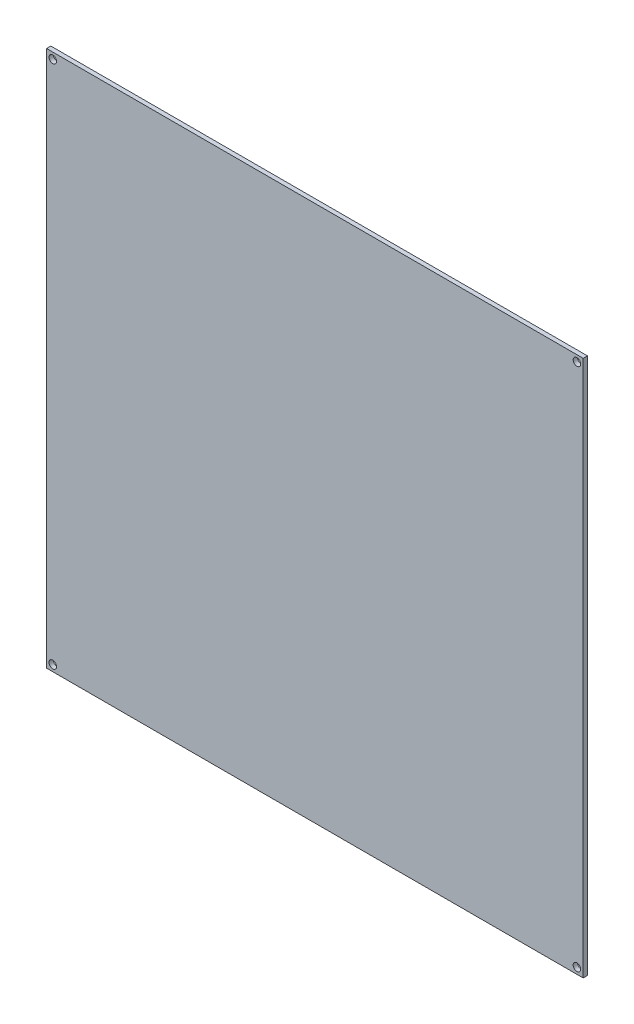
ISO-10303-21;
HEADER;
FILE_DESCRIPTION(('STEP AP214'),'2;1');
FILE_NAME('part.step','',(''),(''),'','','');
FILE_SCHEMA(('AUTOMOTIVE_DESIGN { 1 0 10303 214 1 1 1 1 }'));
ENDSEC;
DATA;
#1=APPLICATION_CONTEXT('core data for automotive mechanical design processes');
#2=APPLICATION_PROTOCOL_DEFINITION('international standard','automotive_design',2000,#1);
#3=PRODUCT_CONTEXT('',#1,'mechanical');
#4=PRODUCT('Part','Part','',(#3));
#5=PRODUCT_RELATED_PRODUCT_CATEGORY('part','',(#4));
#6=PRODUCT_DEFINITION_FORMATION('','',#4);
#7=PRODUCT_DEFINITION_CONTEXT('part definition',#1,'design');
#8=PRODUCT_DEFINITION('design','',#6,#7);
#9=PRODUCT_DEFINITION_SHAPE('','',#8);
#10=(LENGTH_UNIT() NAMED_UNIT(*) SI_UNIT(.MILLI.,.METRE.));
#11=(NAMED_UNIT(*) PLANE_ANGLE_UNIT() SI_UNIT($,.RADIAN.));
#12=(NAMED_UNIT(*) SI_UNIT($,.STERADIAN.) SOLID_ANGLE_UNIT());
#13=UNCERTAINTY_MEASURE_WITH_UNIT(LENGTH_MEASURE(1.E-05),#10,'distance_accuracy_value','');
#14=(GEOMETRIC_REPRESENTATION_CONTEXT(3) GLOBAL_UNCERTAINTY_ASSIGNED_CONTEXT((#13)) GLOBAL_UNIT_ASSIGNED_CONTEXT((#10,
#11,#12)) REPRESENTATION_CONTEXT('',''));
#15=CARTESIAN_POINT('',(0.,0.,0.));
#16=DIRECTION('',(0.,0.,1.));
#17=DIRECTION('',(1.,0.,0.));
#18=AXIS2_PLACEMENT_3D('',#15,#16,#17);
#19=CARTESIAN_POINT('',(0.,0.,-1.7));
#20=DIRECTION('',(-1.,0.,0.));
#21=DIRECTION('',(0.,0.,1.));
#22=AXIS2_PLACEMENT_3D('',#19,#20,#21);
#23=PLANE('',#22);
#24=DIRECTION('',(0.,-1.,0.));
#25=VECTOR('',#24,1.);
#26=CARTESIAN_POINT('',(0.,0.,0.));
#27=LINE('',#26,#25);
#28=CARTESIAN_POINT('',(0.,214.,0.));
#29=VERTEX_POINT('',#28);
#30=CARTESIAN_POINT('',(0.,0.,0.));
#31=VERTEX_POINT('',#30);
#32=EDGE_CURVE('E100',#29,#31,#27,.T.);
#33=ORIENTED_EDGE('',*,*,#32,.F.);
#34=DIRECTION('',(0.,0.,1.));
#35=VECTOR('',#34,1.);
#36=CARTESIAN_POINT('',(0.,214.,-1.7));
#37=LINE('',#36,#35);
#38=CARTESIAN_POINT('',(0.,214.,-1.7));
#39=VERTEX_POINT('',#38);
#40=EDGE_CURVE('E11',#39,#29,#37,.T.);
#41=ORIENTED_EDGE('',*,*,#40,.F.);
#42=DIRECTION('',(0.,-1.,0.));
#43=VECTOR('',#42,1.);
#44=CARTESIAN_POINT('',(0.,0.,-1.7));
#45=LINE('',#44,#43);
#46=CARTESIAN_POINT('',(0.,0.,-1.7));
#47=VERTEX_POINT('',#46);
#48=EDGE_CURVE('E93',#39,#47,#45,.T.);
#49=ORIENTED_EDGE('',*,*,#48,.T.);
#50=DIRECTION('',(0.,0.,1.));
#51=VECTOR('',#50,1.);
#52=CARTESIAN_POINT('',(0.,0.,-1.7));
#53=LINE('',#52,#51);
#54=EDGE_CURVE('E38',#47,#31,#53,.T.);
#55=ORIENTED_EDGE('',*,*,#54,.T.);
#56=EDGE_LOOP('',(#33,#41,#49,#55));
#57=FACE_BOUND('',#56,.T.);
#58=ADVANCED_FACE('F35',(#57),#23,.T.);
#59=CARTESIAN_POINT('',(0.,214.,-1.7));
#60=DIRECTION('',(0.,1.,0.));
#61=DIRECTION('',(0.,0.,1.));
#62=AXIS2_PLACEMENT_3D('',#59,#60,#61);
#63=PLANE('',#62);
#64=DIRECTION('',(-1.,0.,0.));
#65=VECTOR('',#64,1.);
#66=CARTESIAN_POINT('',(0.,214.,0.));
#67=LINE('',#66,#65);
#68=CARTESIAN_POINT('',(214.,214.,0.));
#69=VERTEX_POINT('',#68);
#70=EDGE_CURVE('E95',#69,#29,#67,.T.);
#71=ORIENTED_EDGE('',*,*,#70,.F.);
#72=DIRECTION('',(0.,0.,1.));
#73=VECTOR('',#72,1.);
#74=CARTESIAN_POINT('',(214.,214.,-1.7));
#75=LINE('',#74,#73);
#76=CARTESIAN_POINT('',(214.,214.,-1.7));
#77=VERTEX_POINT('',#76);
#78=EDGE_CURVE('E44',#77,#69,#75,.T.);
#79=ORIENTED_EDGE('',*,*,#78,.F.);
#80=DIRECTION('',(-1.,0.,0.));
#81=VECTOR('',#80,1.);
#82=CARTESIAN_POINT('',(0.,214.,-1.7));
#83=LINE('',#82,#81);
#84=EDGE_CURVE('E90',#77,#39,#83,.T.);
#85=ORIENTED_EDGE('',*,*,#84,.T.);
#86=ORIENTED_EDGE('',*,*,#40,.T.);
#87=EDGE_LOOP('',(#71,#79,#85,#86));
#88=FACE_BOUND('',#87,.T.);
#89=ADVANCED_FACE('F111',(#88),#63,.T.);
#90=CARTESIAN_POINT('',(214.,0.,-1.7));
#91=DIRECTION('',(1.,0.,0.));
#92=DIRECTION('',(0.,0.,-1.));
#93=AXIS2_PLACEMENT_3D('',#90,#91,#92);
#94=PLANE('',#93);
#95=DIRECTION('',(0.,1.,0.));
#96=VECTOR('',#95,1.);
#97=CARTESIAN_POINT('',(214.,0.,0.));
#98=LINE('',#97,#96);
#99=CARTESIAN_POINT('',(214.,0.,0.));
#100=VERTEX_POINT('',#99);
#101=EDGE_CURVE('E85',#100,#69,#98,.T.);
#102=ORIENTED_EDGE('',*,*,#101,.F.);
#103=DIRECTION('',(0.,0.,1.));
#104=VECTOR('',#103,1.);
#105=CARTESIAN_POINT('',(214.,0.,-1.7));
#106=LINE('',#105,#104);
#107=CARTESIAN_POINT('',(214.,0.,-1.7));
#108=VERTEX_POINT('',#107);
#109=EDGE_CURVE('E80',#108,#100,#106,.T.);
#110=ORIENTED_EDGE('',*,*,#109,.F.);
#111=DIRECTION('',(0.,1.,0.));
#112=VECTOR('',#111,1.);
#113=CARTESIAN_POINT('',(214.,0.,-1.7));
#114=LINE('',#113,#112);
#115=EDGE_CURVE('E83',#108,#77,#114,.T.);
#116=ORIENTED_EDGE('',*,*,#115,.T.);
#117=ORIENTED_EDGE('',*,*,#78,.T.);
#118=EDGE_LOOP('',(#102,#110,#116,#117));
#119=FACE_BOUND('',#118,.T.);
#120=ADVANCED_FACE('F82',(#119),#94,.T.);
#121=CARTESIAN_POINT('',(0.,0.,-1.7));
#122=DIRECTION('',(0.,-1.,0.));
#123=DIRECTION('',(0.,0.,-1.));
#124=AXIS2_PLACEMENT_3D('',#121,#122,#123);
#125=PLANE('',#124);
#126=DIRECTION('',(1.,0.,0.));
#127=VECTOR('',#126,1.);
#128=CARTESIAN_POINT('',(0.,0.,0.));
#129=LINE('',#128,#127);
#130=EDGE_CURVE('E103',#31,#100,#129,.T.);
#131=ORIENTED_EDGE('',*,*,#130,.F.);
#132=ORIENTED_EDGE('',*,*,#54,.F.);
#133=DIRECTION('',(1.,0.,0.));
#134=VECTOR('',#133,1.);
#135=CARTESIAN_POINT('',(0.,0.,-1.7));
#136=LINE('',#135,#134);
#137=EDGE_CURVE('E89',#47,#108,#136,.T.);
#138=ORIENTED_EDGE('',*,*,#137,.T.);
#139=ORIENTED_EDGE('',*,*,#109,.T.);
#140=EDGE_LOOP('',(#131,#132,#138,#139));
#141=FACE_BOUND('',#140,.T.);
#142=ADVANCED_FACE('F92',(#141),#125,.T.);
#143=CARTESIAN_POINT('',(0.,0.,-1.7));
#144=DIRECTION('',(0.,0.,-1.));
#145=DIRECTION('',(-1.,0.,0.));
#146=AXIS2_PLACEMENT_3D('',#143,#144,#145);
#147=PLANE('',#146);
#148=CARTESIAN_POINT('',(2.5,2.49999999999995,-1.7));
#149=DIRECTION('',(0.,0.,1.));
#150=DIRECTION('',(-1.,0.,0.));
#151=AXIS2_PLACEMENT_3D('',#148,#149,#150);
#152=CIRCLE('',#151,1.5);
#153=CARTESIAN_POINT('',(1.,2.49999999999995,-1.7));
#154=VERTEX_POINT('',#153);
#155=EDGE_CURVE('E152',#154,#154,#152,.T.);
#156=ORIENTED_EDGE('',*,*,#155,.T.);
#157=EDGE_LOOP('',(#156));
#158=FACE_BOUND('',#157,.T.);
#159=CARTESIAN_POINT('',(211.5,2.49999999999995,-1.7));
#160=DIRECTION('',(0.,0.,1.));
#161=DIRECTION('',(1.,0.,0.));
#162=AXIS2_PLACEMENT_3D('',#159,#160,#161);
#163=CIRCLE('',#162,1.5);
#164=CARTESIAN_POINT('',(213.,2.49999999999995,-1.7));
#165=VERTEX_POINT('',#164);
#166=EDGE_CURVE('E160',#165,#165,#163,.T.);
#167=ORIENTED_EDGE('',*,*,#166,.T.);
#168=EDGE_LOOP('',(#167));
#169=FACE_BOUND('',#168,.T.);
#170=CARTESIAN_POINT('',(211.5,211.5,-1.7));
#171=DIRECTION('',(0.,0.,1.));
#172=DIRECTION('',(-1.,0.,0.));
#173=AXIS2_PLACEMENT_3D('',#170,#171,#172);
#174=CIRCLE('',#173,1.5);
#175=CARTESIAN_POINT('',(210.,211.5,-1.7));
#176=VERTEX_POINT('',#175);
#177=EDGE_CURVE('E166',#176,#176,#174,.T.);
#178=ORIENTED_EDGE('',*,*,#177,.T.);
#179=EDGE_LOOP('',(#178));
#180=FACE_BOUND('',#179,.T.);
#181=CARTESIAN_POINT('',(2.5,211.5,-1.7));
#182=DIRECTION('',(0.,0.,1.));
#183=DIRECTION('',(1.,0.,0.));
#184=AXIS2_PLACEMENT_3D('',#181,#182,#183);
#185=CIRCLE('',#184,1.5);
#186=CARTESIAN_POINT('',(4.,211.5,-1.7));
#187=VERTEX_POINT('',#186);
#188=EDGE_CURVE('E104',#187,#187,#185,.T.);
#189=ORIENTED_EDGE('',*,*,#188,.T.);
#190=EDGE_LOOP('',(#189));
#191=FACE_BOUND('',#190,.T.);
#192=ORIENTED_EDGE('',*,*,#48,.F.);
#193=ORIENTED_EDGE('',*,*,#84,.F.);
#194=ORIENTED_EDGE('',*,*,#115,.F.);
#195=ORIENTED_EDGE('',*,*,#137,.F.);
#196=EDGE_LOOP('',(#192,#193,#194,#195));
#197=FACE_BOUND('',#196,.T.);
#198=ADVANCED_FACE('F88',(#158,#169,#180,#191,#197),#147,.T.);
#199=CARTESIAN_POINT('',(0.,0.,0.));
#200=DIRECTION('',(0.,0.,-1.));
#201=DIRECTION('',(-1.,0.,0.));
#202=AXIS2_PLACEMENT_3D('',#199,#200,#201);
#203=PLANE('',#202);
#204=CARTESIAN_POINT('',(2.5,2.49999999999995,0.));
#205=DIRECTION('',(0.,0.,1.));
#206=DIRECTION('',(-1.,0.,0.));
#207=AXIS2_PLACEMENT_3D('',#204,#205,#206);
#208=CIRCLE('',#207,1.5);
#209=CARTESIAN_POINT('',(1.,2.49999999999995,0.));
#210=VERTEX_POINT('',#209);
#211=EDGE_CURVE('E155',#210,#210,#208,.T.);
#212=ORIENTED_EDGE('',*,*,#211,.F.);
#213=EDGE_LOOP('',(#212));
#214=FACE_BOUND('',#213,.T.);
#215=CARTESIAN_POINT('',(211.5,2.49999999999995,0.));
#216=DIRECTION('',(0.,0.,1.));
#217=DIRECTION('',(1.,0.,0.));
#218=AXIS2_PLACEMENT_3D('',#215,#216,#217);
#219=CIRCLE('',#218,1.5);
#220=CARTESIAN_POINT('',(213.,2.49999999999995,0.));
#221=VERTEX_POINT('',#220);
#222=EDGE_CURVE('E157',#221,#221,#219,.T.);
#223=ORIENTED_EDGE('',*,*,#222,.F.);
#224=EDGE_LOOP('',(#223));
#225=FACE_BOUND('',#224,.T.);
#226=CARTESIAN_POINT('',(211.5,211.5,0.));
#227=DIRECTION('',(0.,0.,1.));
#228=DIRECTION('',(-1.,0.,0.));
#229=AXIS2_PLACEMENT_3D('',#226,#227,#228);
#230=CIRCLE('',#229,1.5);
#231=CARTESIAN_POINT('',(210.,211.5,0.));
#232=VERTEX_POINT('',#231);
#233=EDGE_CURVE('E163',#232,#232,#230,.T.);
#234=ORIENTED_EDGE('',*,*,#233,.F.);
#235=EDGE_LOOP('',(#234));
#236=FACE_BOUND('',#235,.T.);
#237=CARTESIAN_POINT('',(2.5,211.5,0.));
#238=DIRECTION('',(0.,0.,1.));
#239=DIRECTION('',(1.,0.,0.));
#240=AXIS2_PLACEMENT_3D('',#237,#238,#239);
#241=CIRCLE('',#240,1.5);
#242=CARTESIAN_POINT('',(4.,211.5,0.));
#243=VERTEX_POINT('',#242);
#244=EDGE_CURVE('E169',#243,#243,#241,.T.);
#245=ORIENTED_EDGE('',*,*,#244,.F.);
#246=EDGE_LOOP('',(#245));
#247=FACE_BOUND('',#246,.T.);
#248=ORIENTED_EDGE('',*,*,#32,.T.);
#249=ORIENTED_EDGE('',*,*,#130,.T.);
#250=ORIENTED_EDGE('',*,*,#101,.T.);
#251=ORIENTED_EDGE('',*,*,#70,.T.);
#252=EDGE_LOOP('',(#248,#249,#250,#251));
#253=FACE_BOUND('',#252,.T.);
#254=ADVANCED_FACE('F110',(#214,#225,#236,#247,#253),#203,.F.);
#255=CARTESIAN_POINT('',(2.5,211.5,-1.7));
#256=DIRECTION('',(0.,0.,1.));
#257=DIRECTION('',(1.,0.,0.));
#258=AXIS2_PLACEMENT_3D('',#255,#256,#257);
#259=CYLINDRICAL_SURFACE('',#258,1.5);
#260=ORIENTED_EDGE('',*,*,#188,.F.);
#261=EDGE_LOOP('',(#260));
#262=FACE_BOUND('',#261,.T.);
#263=ORIENTED_EDGE('',*,*,#244,.T.);
#264=EDGE_LOOP('',(#263));
#265=FACE_BOUND('',#264,.T.);
#266=ADVANCED_FACE('F129',(#262,#265),#259,.F.);
#267=CARTESIAN_POINT('',(211.5,211.5,-1.7));
#268=DIRECTION('',(0.,0.,1.));
#269=DIRECTION('',(1.,0.,0.));
#270=AXIS2_PLACEMENT_3D('',#267,#268,#269);
#271=CYLINDRICAL_SURFACE('',#270,1.5);
#272=ORIENTED_EDGE('',*,*,#177,.F.);
#273=EDGE_LOOP('',(#272));
#274=FACE_BOUND('',#273,.T.);
#275=ORIENTED_EDGE('',*,*,#233,.T.);
#276=EDGE_LOOP('',(#275));
#277=FACE_BOUND('',#276,.T.);
#278=ADVANCED_FACE('F136',(#274,#277),#271,.F.);
#279=CARTESIAN_POINT('',(211.5,2.49999999999995,-1.7));
#280=DIRECTION('',(0.,0.,1.));
#281=DIRECTION('',(1.,0.,0.));
#282=AXIS2_PLACEMENT_3D('',#279,#280,#281);
#283=CYLINDRICAL_SURFACE('',#282,1.5);
#284=ORIENTED_EDGE('',*,*,#166,.F.);
#285=EDGE_LOOP('',(#284));
#286=FACE_BOUND('',#285,.T.);
#287=ORIENTED_EDGE('',*,*,#222,.T.);
#288=EDGE_LOOP('',(#287));
#289=FACE_BOUND('',#288,.T.);
#290=ADVANCED_FACE('F140',(#286,#289),#283,.F.);
#291=CARTESIAN_POINT('',(2.5,2.49999999999995,-1.7));
#292=DIRECTION('',(0.,0.,1.));
#293=DIRECTION('',(1.,0.,0.));
#294=AXIS2_PLACEMENT_3D('',#291,#292,#293);
#295=CYLINDRICAL_SURFACE('',#294,1.5);
#296=ORIENTED_EDGE('',*,*,#155,.F.);
#297=EDGE_LOOP('',(#296));
#298=FACE_BOUND('',#297,.T.);
#299=ORIENTED_EDGE('',*,*,#211,.T.);
#300=EDGE_LOOP('',(#299));
#301=FACE_BOUND('',#300,.T.);
#302=ADVANCED_FACE('F144',(#298,#301),#295,.F.);
#303=CLOSED_SHELL('',(#58,#89,#120,#142,#198,#254,#266,#278,#290,#302));
#304=MANIFOLD_SOLID_BREP('B2',#303);
#305=ADVANCED_BREP_SHAPE_REPRESENTATION('',(#18,#304),#14);
#306=SHAPE_DEFINITION_REPRESENTATION(#9,#305);
ENDSEC;
END-ISO-10303-21;
